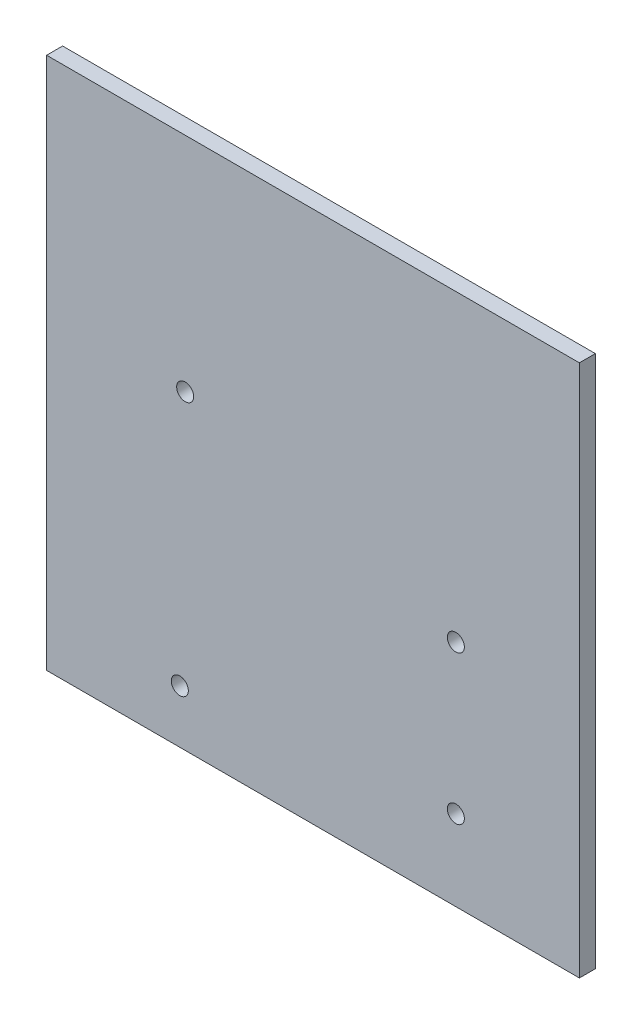
ISO-10303-21;
HEADER;
FILE_DESCRIPTION(('STEP AP214'),'2;1');
FILE_NAME('part.step','',(''),(''),'','','');
FILE_SCHEMA(('AUTOMOTIVE_DESIGN { 1 0 10303 214 1 1 1 1 }'));
ENDSEC;
DATA;
#1=APPLICATION_CONTEXT('core data for automotive mechanical design processes');
#2=APPLICATION_PROTOCOL_DEFINITION('international standard','automotive_design',2000,#1);
#3=PRODUCT_CONTEXT('',#1,'mechanical');
#4=PRODUCT('Part','Part','',(#3));
#5=PRODUCT_RELATED_PRODUCT_CATEGORY('part','',(#4));
#6=PRODUCT_DEFINITION_FORMATION('','',#4);
#7=PRODUCT_DEFINITION_CONTEXT('part definition',#1,'design');
#8=PRODUCT_DEFINITION('design','',#6,#7);
#9=PRODUCT_DEFINITION_SHAPE('','',#8);
#10=(LENGTH_UNIT() NAMED_UNIT(*) SI_UNIT(.MILLI.,.METRE.));
#11=(NAMED_UNIT(*) PLANE_ANGLE_UNIT() SI_UNIT($,.RADIAN.));
#12=(NAMED_UNIT(*) SI_UNIT($,.STERADIAN.) SOLID_ANGLE_UNIT());
#13=UNCERTAINTY_MEASURE_WITH_UNIT(LENGTH_MEASURE(1.E-05),#10,'distance_accuracy_value','');
#14=(GEOMETRIC_REPRESENTATION_CONTEXT(3) GLOBAL_UNCERTAINTY_ASSIGNED_CONTEXT((#13)) GLOBAL_UNIT_ASSIGNED_CONTEXT((#10,
#11,#12)) REPRESENTATION_CONTEXT('',''));
#15=CARTESIAN_POINT('',(0.,0.,0.));
#16=DIRECTION('',(0.,0.,1.));
#17=DIRECTION('',(1.,0.,0.));
#18=AXIS2_PLACEMENT_3D('',#15,#16,#17);
#19=CARTESIAN_POINT('',(50.,50.,3.));
#20=DIRECTION('',(-1.,0.,0.));
#21=DIRECTION('',(0.,-1.,0.));
#22=AXIS2_PLACEMENT_3D('',#19,#20,#21);
#23=PLANE('',#22);
#24=DIRECTION('',(0.,1.,0.));
#25=VECTOR('',#24,1.);
#26=CARTESIAN_POINT('',(50.,50.,0.));
#27=LINE('',#26,#25);
#28=CARTESIAN_POINT('',(50.,-50.,0.));
#29=VERTEX_POINT('',#28);
#30=CARTESIAN_POINT('',(50.,50.,0.));
#31=VERTEX_POINT('',#30);
#32=EDGE_CURVE('E105',#29,#31,#27,.T.);
#33=ORIENTED_EDGE('',*,*,#32,.T.);
#34=DIRECTION('',(0.,0.,-1.));
#35=VECTOR('',#34,1.);
#36=CARTESIAN_POINT('',(50.,50.,3.));
#37=LINE('',#36,#35);
#38=CARTESIAN_POINT('',(50.,50.,3.));
#39=VERTEX_POINT('',#38);
#40=EDGE_CURVE('E11',#39,#31,#37,.T.);
#41=ORIENTED_EDGE('',*,*,#40,.F.);
#42=DIRECTION('',(0.,1.,0.));
#43=VECTOR('',#42,1.);
#44=CARTESIAN_POINT('',(50.,50.,3.));
#45=LINE('',#44,#43);
#46=CARTESIAN_POINT('',(50.,-50.,3.));
#47=VERTEX_POINT('',#46);
#48=EDGE_CURVE('E92',#47,#39,#45,.T.);
#49=ORIENTED_EDGE('',*,*,#48,.F.);
#50=DIRECTION('',(0.,0.,-1.));
#51=VECTOR('',#50,1.);
#52=CARTESIAN_POINT('',(50.,-50.,3.));
#53=LINE('',#52,#51);
#54=EDGE_CURVE('E101',#47,#29,#53,.T.);
#55=ORIENTED_EDGE('',*,*,#54,.T.);
#56=EDGE_LOOP('',(#33,#41,#49,#55));
#57=FACE_BOUND('',#56,.T.);
#58=ADVANCED_FACE('F39',(#57),#23,.F.);
#59=CARTESIAN_POINT('',(-50.,50.,3.));
#60=DIRECTION('',(0.,-1.,0.));
#61=DIRECTION('',(1.,0.,0.));
#62=AXIS2_PLACEMENT_3D('',#59,#60,#61);
#63=PLANE('',#62);
#64=DIRECTION('',(-1.,0.,0.));
#65=VECTOR('',#64,1.);
#66=CARTESIAN_POINT('',(-50.,50.,0.));
#67=LINE('',#66,#65);
#68=CARTESIAN_POINT('',(-50.,50.,0.));
#69=VERTEX_POINT('',#68);
#70=EDGE_CURVE('E96',#31,#69,#67,.T.);
#71=ORIENTED_EDGE('',*,*,#70,.T.);
#72=DIRECTION('',(0.,0.,-1.));
#73=VECTOR('',#72,1.);
#74=CARTESIAN_POINT('',(-50.,50.,3.));
#75=LINE('',#74,#73);
#76=CARTESIAN_POINT('',(-50.,50.,3.));
#77=VERTEX_POINT('',#76);
#78=EDGE_CURVE('E48',#77,#69,#75,.T.);
#79=ORIENTED_EDGE('',*,*,#78,.F.);
#80=DIRECTION('',(-1.,0.,0.));
#81=VECTOR('',#80,1.);
#82=CARTESIAN_POINT('',(-50.,50.,3.));
#83=LINE('',#82,#81);
#84=EDGE_CURVE('E87',#39,#77,#83,.T.);
#85=ORIENTED_EDGE('',*,*,#84,.F.);
#86=ORIENTED_EDGE('',*,*,#40,.T.);
#87=EDGE_LOOP('',(#71,#79,#85,#86));
#88=FACE_BOUND('',#87,.T.);
#89=ADVANCED_FACE('F95',(#88),#63,.F.);
#90=CARTESIAN_POINT('',(-50.,50.,3.));
#91=DIRECTION('',(1.,0.,0.));
#92=DIRECTION('',(0.,1.,0.));
#93=AXIS2_PLACEMENT_3D('',#90,#91,#92);
#94=PLANE('',#93);
#95=DIRECTION('',(0.,-1.,0.));
#96=VECTOR('',#95,1.);
#97=CARTESIAN_POINT('',(-50.,50.,0.));
#98=LINE('',#97,#96);
#99=CARTESIAN_POINT('',(-50.,-50.,0.));
#100=VERTEX_POINT('',#99);
#101=EDGE_CURVE('E74',#69,#100,#98,.T.);
#102=ORIENTED_EDGE('',*,*,#101,.T.);
#103=DIRECTION('',(0.,0.,-1.));
#104=VECTOR('',#103,1.);
#105=CARTESIAN_POINT('',(-50.,-50.,3.));
#106=LINE('',#105,#104);
#107=CARTESIAN_POINT('',(-50.,-50.,3.));
#108=VERTEX_POINT('',#107);
#109=EDGE_CURVE('E97',#108,#100,#106,.T.);
#110=ORIENTED_EDGE('',*,*,#109,.F.);
#111=DIRECTION('',(0.,-1.,0.));
#112=VECTOR('',#111,1.);
#113=CARTESIAN_POINT('',(-50.,50.,3.));
#114=LINE('',#113,#112);
#115=EDGE_CURVE('E90',#77,#108,#114,.T.);
#116=ORIENTED_EDGE('',*,*,#115,.F.);
#117=ORIENTED_EDGE('',*,*,#78,.T.);
#118=EDGE_LOOP('',(#102,#110,#116,#117));
#119=FACE_BOUND('',#118,.T.);
#120=ADVANCED_FACE('F99',(#119),#94,.F.);
#121=CARTESIAN_POINT('',(-50.,-50.,3.));
#122=DIRECTION('',(0.,1.,0.));
#123=DIRECTION('',(-1.,0.,0.));
#124=AXIS2_PLACEMENT_3D('',#121,#122,#123);
#125=PLANE('',#124);
#126=DIRECTION('',(1.,0.,0.));
#127=VECTOR('',#126,1.);
#128=CARTESIAN_POINT('',(-50.,-50.,0.));
#129=LINE('',#128,#127);
#130=EDGE_CURVE('E80',#100,#29,#129,.T.);
#131=ORIENTED_EDGE('',*,*,#130,.T.);
#132=ORIENTED_EDGE('',*,*,#54,.F.);
#133=DIRECTION('',(1.,0.,0.));
#134=VECTOR('',#133,1.);
#135=CARTESIAN_POINT('',(-50.,-50.,3.));
#136=LINE('',#135,#134);
#137=EDGE_CURVE('E57',#108,#47,#136,.T.);
#138=ORIENTED_EDGE('',*,*,#137,.F.);
#139=ORIENTED_EDGE('',*,*,#109,.T.);
#140=EDGE_LOOP('',(#131,#132,#138,#139));
#141=FACE_BOUND('',#140,.T.);
#142=ADVANCED_FACE('F156',(#141),#125,.F.);
#143=CARTESIAN_POINT('',(0.,0.,3.));
#144=DIRECTION('',(0.,0.,1.));
#145=DIRECTION('',(1.,0.,0.));
#146=AXIS2_PLACEMENT_3D('',#143,#144,#145);
#147=PLANE('',#146);
#148=CARTESIAN_POINT('',(-23.9925225828861,8.28949149922791,3.));
#149=DIRECTION('',(0.,0.,1.));
#150=DIRECTION('',(1.,0.,0.));
#151=AXIS2_PLACEMENT_3D('',#148,#149,#150);
#152=CIRCLE('',#151,1.6);
#153=CARTESIAN_POINT('',(-22.3925225828861,8.28949149922791,3.));
#154=VERTEX_POINT('',#153);
#155=EDGE_CURVE('E223',#154,#154,#152,.T.);
#156=ORIENTED_EDGE('',*,*,#155,.F.);
#157=EDGE_LOOP('',(#156));
#158=FACE_BOUND('',#157,.T.);
#159=CARTESIAN_POINT('',(-25.,-40.,3.));
#160=DIRECTION('',(0.,0.,1.));
#161=DIRECTION('',(1.,0.,0.));
#162=AXIS2_PLACEMENT_3D('',#159,#160,#161);
#163=CIRCLE('',#162,1.6);
#164=CARTESIAN_POINT('',(-23.4,-40.,3.));
#165=VERTEX_POINT('',#164);
#166=EDGE_CURVE('E218',#165,#165,#163,.T.);
#167=ORIENTED_EDGE('',*,*,#166,.F.);
#168=EDGE_LOOP('',(#167));
#169=FACE_BOUND('',#168,.T.);
#170=CARTESIAN_POINT('',(26.8074774171139,-7.00000000000002,3.));
#171=DIRECTION('',(0.,0.,1.));
#172=DIRECTION('',(1.,0.,0.));
#173=AXIS2_PLACEMENT_3D('',#170,#171,#172);
#174=CIRCLE('',#173,1.6);
#175=CARTESIAN_POINT('',(28.4074774171139,-7.00000000000002,3.));
#176=VERTEX_POINT('',#175);
#177=EDGE_CURVE('E211',#176,#176,#174,.T.);
#178=ORIENTED_EDGE('',*,*,#177,.F.);
#179=EDGE_LOOP('',(#178));
#180=FACE_BOUND('',#179,.T.);
#181=CARTESIAN_POINT('',(26.8074774171139,-34.9,3.));
#182=DIRECTION('',(0.,0.,1.));
#183=DIRECTION('',(1.,0.,0.));
#184=AXIS2_PLACEMENT_3D('',#181,#182,#183);
#185=CIRCLE('',#184,1.6);
#186=CARTESIAN_POINT('',(28.4074774171139,-34.9,3.));
#187=VERTEX_POINT('',#186);
#188=EDGE_CURVE('E117',#187,#187,#185,.T.);
#189=ORIENTED_EDGE('',*,*,#188,.F.);
#190=EDGE_LOOP('',(#189));
#191=FACE_BOUND('',#190,.T.);
#192=ORIENTED_EDGE('',*,*,#48,.T.);
#193=ORIENTED_EDGE('',*,*,#84,.T.);
#194=ORIENTED_EDGE('',*,*,#115,.T.);
#195=ORIENTED_EDGE('',*,*,#137,.T.);
#196=EDGE_LOOP('',(#192,#193,#194,#195));
#197=FACE_BOUND('',#196,.T.);
#198=ADVANCED_FACE('F88',(#158,#169,#180,#191,#197),#147,.T.);
#199=CARTESIAN_POINT('',(0.,0.,0.));
#200=DIRECTION('',(0.,0.,1.));
#201=DIRECTION('',(1.,0.,0.));
#202=AXIS2_PLACEMENT_3D('',#199,#200,#201);
#203=PLANE('',#202);
#204=CARTESIAN_POINT('',(-23.9925225828861,8.28949149922791,0.));
#205=DIRECTION('',(0.,0.,1.));
#206=DIRECTION('',(1.,0.,0.));
#207=AXIS2_PLACEMENT_3D('',#204,#205,#206);
#208=CIRCLE('',#207,1.6);
#209=CARTESIAN_POINT('',(-22.3925225828861,8.28949149922791,0.));
#210=VERTEX_POINT('',#209);
#211=EDGE_CURVE('E42',#210,#210,#208,.T.);
#212=ORIENTED_EDGE('',*,*,#211,.T.);
#213=EDGE_LOOP('',(#212));
#214=FACE_BOUND('',#213,.T.);
#215=CARTESIAN_POINT('',(-25.,-40.,0.));
#216=DIRECTION('',(0.,0.,1.));
#217=DIRECTION('',(1.,0.,0.));
#218=AXIS2_PLACEMENT_3D('',#215,#216,#217);
#219=CIRCLE('',#218,1.6);
#220=CARTESIAN_POINT('',(-23.4,-40.,0.));
#221=VERTEX_POINT('',#220);
#222=EDGE_CURVE('E119',#221,#221,#219,.T.);
#223=ORIENTED_EDGE('',*,*,#222,.T.);
#224=EDGE_LOOP('',(#223));
#225=FACE_BOUND('',#224,.T.);
#226=CARTESIAN_POINT('',(26.8074774171139,-7.00000000000002,0.));
#227=DIRECTION('',(0.,0.,1.));
#228=DIRECTION('',(1.,0.,0.));
#229=AXIS2_PLACEMENT_3D('',#226,#227,#228);
#230=CIRCLE('',#229,1.6);
#231=CARTESIAN_POINT('',(28.4074774171139,-7.00000000000002,0.));
#232=VERTEX_POINT('',#231);
#233=EDGE_CURVE('E116',#232,#232,#230,.T.);
#234=ORIENTED_EDGE('',*,*,#233,.T.);
#235=EDGE_LOOP('',(#234));
#236=FACE_BOUND('',#235,.T.);
#237=CARTESIAN_POINT('',(26.8074774171139,-34.9,0.));
#238=DIRECTION('',(0.,0.,1.));
#239=DIRECTION('',(1.,0.,0.));
#240=AXIS2_PLACEMENT_3D('',#237,#238,#239);
#241=CIRCLE('',#240,1.6);
#242=CARTESIAN_POINT('',(28.4074774171139,-34.9,0.));
#243=VERTEX_POINT('',#242);
#244=EDGE_CURVE('E113',#243,#243,#241,.T.);
#245=ORIENTED_EDGE('',*,*,#244,.T.);
#246=EDGE_LOOP('',(#245));
#247=FACE_BOUND('',#246,.T.);
#248=ORIENTED_EDGE('',*,*,#32,.F.);
#249=ORIENTED_EDGE('',*,*,#130,.F.);
#250=ORIENTED_EDGE('',*,*,#101,.F.);
#251=ORIENTED_EDGE('',*,*,#70,.F.);
#252=EDGE_LOOP('',(#248,#249,#250,#251));
#253=FACE_BOUND('',#252,.T.);
#254=ADVANCED_FACE('F126',(#214,#225,#236,#247,#253),#203,.F.);
#255=CARTESIAN_POINT('',(26.8074774171139,-34.9,-56.));
#256=DIRECTION('',(0.,0.,1.));
#257=DIRECTION('',(1.,0.,0.));
#258=AXIS2_PLACEMENT_3D('',#255,#256,#257);
#259=CYLINDRICAL_SURFACE('',#258,1.6);
#260=ORIENTED_EDGE('',*,*,#188,.T.);
#261=EDGE_LOOP('',(#260));
#262=FACE_BOUND('',#261,.T.);
#263=ORIENTED_EDGE('',*,*,#244,.F.);
#264=EDGE_LOOP('',(#263));
#265=FACE_BOUND('',#264,.T.);
#266=ADVANCED_FACE('F149',(#262,#265),#259,.F.);
#267=CARTESIAN_POINT('',(26.8074774171139,-7.00000000000002,-56.));
#268=DIRECTION('',(0.,0.,1.));
#269=DIRECTION('',(1.,0.,0.));
#270=AXIS2_PLACEMENT_3D('',#267,#268,#269);
#271=CYLINDRICAL_SURFACE('',#270,1.6);
#272=ORIENTED_EDGE('',*,*,#177,.T.);
#273=EDGE_LOOP('',(#272));
#274=FACE_BOUND('',#273,.T.);
#275=ORIENTED_EDGE('',*,*,#233,.F.);
#276=EDGE_LOOP('',(#275));
#277=FACE_BOUND('',#276,.T.);
#278=ADVANCED_FACE('F136',(#274,#277),#271,.F.);
#279=CARTESIAN_POINT('',(-25.,-40.,-56.));
#280=DIRECTION('',(0.,0.,1.));
#281=DIRECTION('',(1.,0.,0.));
#282=AXIS2_PLACEMENT_3D('',#279,#280,#281);
#283=CYLINDRICAL_SURFACE('',#282,1.6);
#284=ORIENTED_EDGE('',*,*,#166,.T.);
#285=EDGE_LOOP('',(#284));
#286=FACE_BOUND('',#285,.T.);
#287=ORIENTED_EDGE('',*,*,#222,.F.);
#288=EDGE_LOOP('',(#287));
#289=FACE_BOUND('',#288,.T.);
#290=ADVANCED_FACE('F130',(#286,#289),#283,.F.);
#291=CARTESIAN_POINT('',(-23.9925225828861,8.28949149922791,-56.));
#292=DIRECTION('',(0.,0.,1.));
#293=DIRECTION('',(1.,0.,0.));
#294=AXIS2_PLACEMENT_3D('',#291,#292,#293);
#295=CYLINDRICAL_SURFACE('',#294,1.6);
#296=ORIENTED_EDGE('',*,*,#155,.T.);
#297=EDGE_LOOP('',(#296));
#298=FACE_BOUND('',#297,.T.);
#299=ORIENTED_EDGE('',*,*,#211,.F.);
#300=EDGE_LOOP('',(#299));
#301=FACE_BOUND('',#300,.T.);
#302=ADVANCED_FACE('F128',(#298,#301),#295,.F.);
#303=CLOSED_SHELL('',(#58,#89,#120,#142,#198,#254,#266,#278,#290,#302));
#304=MANIFOLD_SOLID_BREP('B2',#303);
#305=ADVANCED_BREP_SHAPE_REPRESENTATION('',(#18,#304),#14);
#306=SHAPE_DEFINITION_REPRESENTATION(#9,#305);
ENDSEC;
END-ISO-10303-21;
